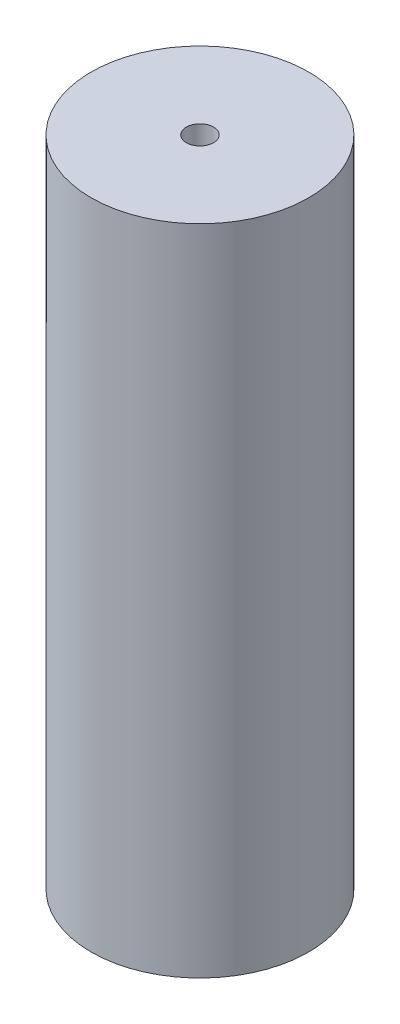
ISO-10303-21;
HEADER;
FILE_DESCRIPTION(('STEP AP214'),'2;1');
FILE_NAME('part.step','',(''),(''),'','','');
FILE_SCHEMA(('AUTOMOTIVE_DESIGN { 1 0 10303 214 1 1 1 1 }'));
ENDSEC;
DATA;
#1=APPLICATION_CONTEXT('core data for automotive mechanical design processes');
#2=APPLICATION_PROTOCOL_DEFINITION('international standard','automotive_design',2000,#1);
#3=PRODUCT_CONTEXT('',#1,'mechanical');
#4=PRODUCT('Part','Part','',(#3));
#5=PRODUCT_RELATED_PRODUCT_CATEGORY('part','',(#4));
#6=PRODUCT_DEFINITION_FORMATION('','',#4);
#7=PRODUCT_DEFINITION_CONTEXT('part definition',#1,'design');
#8=PRODUCT_DEFINITION('design','',#6,#7);
#9=PRODUCT_DEFINITION_SHAPE('','',#8);
#10=(LENGTH_UNIT() NAMED_UNIT(*) SI_UNIT(.MILLI.,.METRE.));
#11=(NAMED_UNIT(*) PLANE_ANGLE_UNIT() SI_UNIT($,.RADIAN.));
#12=(NAMED_UNIT(*) SI_UNIT($,.STERADIAN.) SOLID_ANGLE_UNIT());
#13=UNCERTAINTY_MEASURE_WITH_UNIT(LENGTH_MEASURE(1.E-05),#10,'distance_accuracy_value','');
#14=(GEOMETRIC_REPRESENTATION_CONTEXT(3) GLOBAL_UNCERTAINTY_ASSIGNED_CONTEXT((#13)) GLOBAL_UNIT_ASSIGNED_CONTEXT((#10,
#11,#12)) REPRESENTATION_CONTEXT('',''));
#15=CARTESIAN_POINT('',(0.,0.,0.));
#16=DIRECTION('',(0.,0.,1.));
#17=DIRECTION('',(1.,0.,0.));
#18=AXIS2_PLACEMENT_3D('',#15,#16,#17);
#19=CARTESIAN_POINT('',(0.,152.4,0.));
#20=DIRECTION('',(0.,-1.,0.));
#21=DIRECTION('',(0.,0.,-1.));
#22=AXIS2_PLACEMENT_3D('',#19,#20,#21);
#23=CYLINDRICAL_SURFACE('',#22,25.4);
#24=CARTESIAN_POINT('',(0.,152.4,0.));
#25=DIRECTION('',(0.,1.,0.));
#26=DIRECTION('',(0.,0.,1.));
#27=AXIS2_PLACEMENT_3D('',#24,#25,#26);
#28=CIRCLE('',#27,25.4);
#29=CARTESIAN_POINT('',(0.,152.4,25.4));
#30=VERTEX_POINT('',#29);
#31=EDGE_CURVE('E10',#30,#30,#28,.T.);
#32=ORIENTED_EDGE('',*,*,#31,.F.);
#33=EDGE_LOOP('',(#32));
#34=FACE_BOUND('',#33,.T.);
#35=CARTESIAN_POINT('',(0.,0.,0.));
#36=DIRECTION('',(0.,1.,0.));
#37=DIRECTION('',(0.,0.,1.));
#38=AXIS2_PLACEMENT_3D('',#35,#36,#37);
#39=CIRCLE('',#38,25.4);
#40=CARTESIAN_POINT('',(0.,0.,25.4));
#41=VERTEX_POINT('',#40);
#42=EDGE_CURVE('E34',#41,#41,#39,.T.);
#43=ORIENTED_EDGE('',*,*,#42,.T.);
#44=EDGE_LOOP('',(#43));
#45=FACE_BOUND('',#44,.T.);
#46=ADVANCED_FACE('F31',(#34,#45),#23,.T.);
#47=CARTESIAN_POINT('',(0.,152.4,0.));
#48=DIRECTION('',(0.,1.,0.));
#49=DIRECTION('',(0.,0.,1.));
#50=AXIS2_PLACEMENT_3D('',#47,#48,#49);
#51=PLANE('',#50);
#52=CARTESIAN_POINT('',(0.,152.4,0.));
#53=DIRECTION('',(0.,-1.,0.));
#54=DIRECTION('',(0.,0.,-1.));
#55=AXIS2_PLACEMENT_3D('',#52,#53,#54);
#56=CIRCLE('',#55,3.175);
#57=CARTESIAN_POINT('',(0.,152.4,-3.175));
#58=VERTEX_POINT('',#57);
#59=EDGE_CURVE('E41',#58,#58,#56,.T.);
#60=ORIENTED_EDGE('',*,*,#59,.T.);
#61=EDGE_LOOP('',(#60));
#62=FACE_BOUND('',#61,.T.);
#63=ORIENTED_EDGE('',*,*,#31,.T.);
#64=EDGE_LOOP('',(#63));
#65=FACE_BOUND('',#64,.T.);
#66=ADVANCED_FACE('F49',(#62,#65),#51,.T.);
#67=CARTESIAN_POINT('',(0.,0.,0.));
#68=DIRECTION('',(0.,1.,0.));
#69=DIRECTION('',(0.,0.,1.));
#70=AXIS2_PLACEMENT_3D('',#67,#68,#69);
#71=PLANE('',#70);
#72=CARTESIAN_POINT('',(0.,0.,0.));
#73=DIRECTION('',(0.,-1.,0.));
#74=DIRECTION('',(0.,0.,-1.));
#75=AXIS2_PLACEMENT_3D('',#72,#73,#74);
#76=CIRCLE('',#75,3.175);
#77=CARTESIAN_POINT('',(0.,0.,-3.175));
#78=VERTEX_POINT('',#77);
#79=EDGE_CURVE('E43',#78,#78,#76,.T.);
#80=ORIENTED_EDGE('',*,*,#79,.F.);
#81=EDGE_LOOP('',(#80));
#82=FACE_BOUND('',#81,.T.);
#83=ORIENTED_EDGE('',*,*,#42,.F.);
#84=EDGE_LOOP('',(#83));
#85=FACE_BOUND('',#84,.T.);
#86=ADVANCED_FACE('F54',(#82,#85),#71,.F.);
#87=CARTESIAN_POINT('',(0.,152.4,0.));
#88=DIRECTION('',(0.,-1.,0.));
#89=DIRECTION('',(0.,0.,-1.));
#90=AXIS2_PLACEMENT_3D('',#87,#88,#89);
#91=CYLINDRICAL_SURFACE('',#90,3.175);
#92=ORIENTED_EDGE('',*,*,#59,.F.);
#93=EDGE_LOOP('',(#92));
#94=FACE_BOUND('',#93,.T.);
#95=ORIENTED_EDGE('',*,*,#79,.T.);
#96=EDGE_LOOP('',(#95));
#97=FACE_BOUND('',#96,.T.);
#98=ADVANCED_FACE('F51',(#94,#97),#91,.F.);
#99=CLOSED_SHELL('',(#46,#66,#86,#98));
#100=MANIFOLD_SOLID_BREP('B2',#99);
#101=ADVANCED_BREP_SHAPE_REPRESENTATION('',(#18,#100),#14);
#102=SHAPE_DEFINITION_REPRESENTATION(#9,#101);
ENDSEC;
END-ISO-10303-21;
